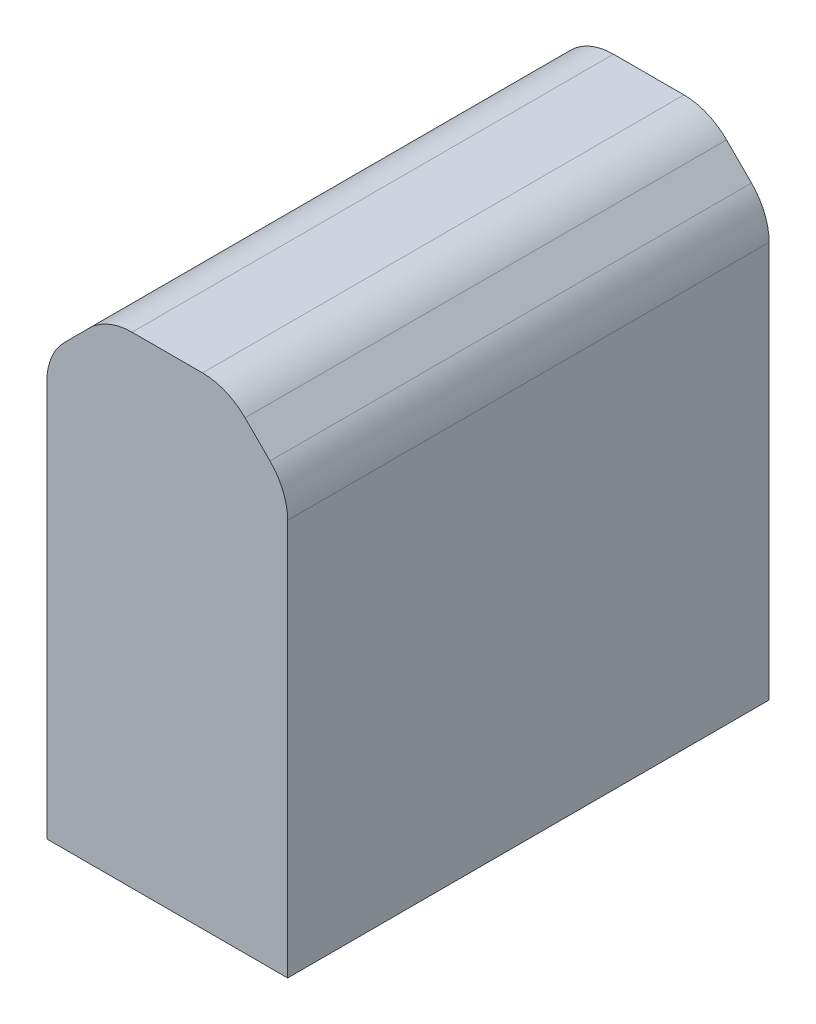
ISO-10303-21;
HEADER;
FILE_DESCRIPTION(('STEP AP214'),'2;1');
FILE_NAME('part.step','',(''),(''),'','','');
FILE_SCHEMA(('AUTOMOTIVE_DESIGN { 1 0 10303 214 1 1 1 1 }'));
ENDSEC;
DATA;
#1=APPLICATION_CONTEXT('core data for automotive mechanical design processes');
#2=APPLICATION_PROTOCOL_DEFINITION('international standard','automotive_design',2000,#1);
#3=PRODUCT_CONTEXT('',#1,'mechanical');
#4=PRODUCT('Part','Part','',(#3));
#5=PRODUCT_RELATED_PRODUCT_CATEGORY('part','',(#4));
#6=PRODUCT_DEFINITION_FORMATION('','',#4);
#7=PRODUCT_DEFINITION_CONTEXT('part definition',#1,'design');
#8=PRODUCT_DEFINITION('design','',#6,#7);
#9=PRODUCT_DEFINITION_SHAPE('','',#8);
#10=(LENGTH_UNIT() NAMED_UNIT(*) SI_UNIT(.MILLI.,.METRE.));
#11=(NAMED_UNIT(*) PLANE_ANGLE_UNIT() SI_UNIT($,.RADIAN.));
#12=(NAMED_UNIT(*) SI_UNIT($,.STERADIAN.) SOLID_ANGLE_UNIT());
#13=UNCERTAINTY_MEASURE_WITH_UNIT(LENGTH_MEASURE(1.E-05),#10,'distance_accuracy_value','');
#14=(GEOMETRIC_REPRESENTATION_CONTEXT(3) GLOBAL_UNCERTAINTY_ASSIGNED_CONTEXT((#13)) GLOBAL_UNIT_ASSIGNED_CONTEXT((#10,
#11,#12)) REPRESENTATION_CONTEXT('',''));
#15=CARTESIAN_POINT('',(0.,0.,0.));
#16=DIRECTION('',(0.,0.,1.));
#17=DIRECTION('',(1.,0.,0.));
#18=AXIS2_PLACEMENT_3D('',#15,#16,#17);
#19=CARTESIAN_POINT('',(1.,4.,-2.));
#20=DIRECTION('',(-1.,0.,0.));
#21=DIRECTION('',(0.,0.,1.));
#22=AXIS2_PLACEMENT_3D('',#19,#20,#21);
#23=PLANE('',#22);
#24=DIRECTION('',(0.,-1.,0.));
#25=VECTOR('',#24,1.);
#26=CARTESIAN_POINT('',(1.,4.,-2.));
#27=LINE('',#26,#25);
#28=CARTESIAN_POINT('',(1.,3.29289321881345,-2.));
#29=VERTEX_POINT('',#28);
#30=CARTESIAN_POINT('',(1.,0.,-2.));
#31=VERTEX_POINT('',#30);
#32=EDGE_CURVE('E108',#29,#31,#27,.T.);
#33=ORIENTED_EDGE('',*,*,#32,.F.);
#34=DIRECTION('',(0.,0.,1.));
#35=VECTOR('',#34,1.);
#36=CARTESIAN_POINT('',(1.,3.29289321881345,2.));
#37=LINE('',#36,#35);
#38=CARTESIAN_POINT('',(1.,3.29289321881345,2.));
#39=VERTEX_POINT('',#38);
#40=EDGE_CURVE('E183',#29,#39,#37,.T.);
#41=ORIENTED_EDGE('',*,*,#40,.T.);
#42=DIRECTION('',(0.,-1.,0.));
#43=VECTOR('',#42,1.);
#44=CARTESIAN_POINT('',(1.,4.,2.));
#45=LINE('',#44,#43);
#46=CARTESIAN_POINT('',(1.,0.,2.));
#47=VERTEX_POINT('',#46);
#48=EDGE_CURVE('E132',#39,#47,#45,.T.);
#49=ORIENTED_EDGE('',*,*,#48,.T.);
#50=DIRECTION('',(0.,0.,-1.));
#51=VECTOR('',#50,1.);
#52=CARTESIAN_POINT('',(1.,0.,-2.));
#53=LINE('',#52,#51);
#54=EDGE_CURVE('E128',#47,#31,#53,.T.);
#55=ORIENTED_EDGE('',*,*,#54,.T.);
#56=EDGE_LOOP('',(#33,#41,#49,#55));
#57=FACE_BOUND('',#56,.T.);
#58=ADVANCED_FACE('F32',(#57),#23,.F.);
#59=CARTESIAN_POINT('',(-1.,4.,-2.));
#60=DIRECTION('',(0.,0.,1.));
#61=DIRECTION('',(1.,0.,0.));
#62=AXIS2_PLACEMENT_3D('',#59,#60,#61);
#63=PLANE('',#62);
#64=DIRECTION('',(0.,-1.,0.));
#65=VECTOR('',#64,1.);
#66=CARTESIAN_POINT('',(-1.,4.,-2.));
#67=LINE('',#66,#65);
#68=CARTESIAN_POINT('',(-1.,3.29289321881345,-2.));
#69=VERTEX_POINT('',#68);
#70=CARTESIAN_POINT('',(-1.,0.,-2.));
#71=VERTEX_POINT('',#70);
#72=EDGE_CURVE('E122',#69,#71,#67,.T.);
#73=ORIENTED_EDGE('',*,*,#72,.F.);
#74=CARTESIAN_POINT('',(-0.5,3.29289321881345,-2.));
#75=DIRECTION('',(0.,0.,1.));
#76=DIRECTION('',(1.,0.,0.));
#77=AXIS2_PLACEMENT_3D('',#74,#75,#76);
#78=CIRCLE('',#77,0.5);
#79=CARTESIAN_POINT('',(-0.853553390593275,3.64644660940672,-2.));
#80=VERTEX_POINT('',#79);
#81=EDGE_CURVE('E164',#69,#80,#78,.F.);
#82=ORIENTED_EDGE('',*,*,#81,.T.);
#83=DIRECTION('',(0.707106781186546,0.707106781186549,0.));
#84=VECTOR('',#83,1.);
#85=CARTESIAN_POINT('',(-0.5,4.,-2.));
#86=LINE('',#85,#84);
#87=CARTESIAN_POINT('',(-0.646446609406727,3.85355339059327,-2.));
#88=VERTEX_POINT('',#87);
#89=EDGE_CURVE('E153',#80,#88,#86,.T.);
#90=ORIENTED_EDGE('',*,*,#89,.T.);
#91=CARTESIAN_POINT('',(-0.292893218813452,3.5,-2.));
#92=DIRECTION('',(0.,0.,1.));
#93=DIRECTION('',(1.,0.,0.));
#94=AXIS2_PLACEMENT_3D('',#91,#92,#93);
#95=CIRCLE('',#94,0.5);
#96=CARTESIAN_POINT('',(-0.292893218813452,4.,-2.));
#97=VERTEX_POINT('',#96);
#98=EDGE_CURVE('E162',#88,#97,#95,.F.);
#99=ORIENTED_EDGE('',*,*,#98,.T.);
#100=DIRECTION('',(-1.,0.,0.));
#101=VECTOR('',#100,1.);
#102=CARTESIAN_POINT('',(-1.,4.,-2.));
#103=LINE('',#102,#101);
#104=CARTESIAN_POINT('',(0.292893218813453,4.,-2.));
#105=VERTEX_POINT('',#104);
#106=EDGE_CURVE('E142',#105,#97,#103,.T.);
#107=ORIENTED_EDGE('',*,*,#106,.F.);
#108=CARTESIAN_POINT('',(0.292893218813453,3.5,-2.));
#109=DIRECTION('',(0.,0.,1.));
#110=DIRECTION('',(1.,0.,0.));
#111=AXIS2_PLACEMENT_3D('',#108,#109,#110);
#112=CIRCLE('',#111,0.5);
#113=CARTESIAN_POINT('',(0.646446609406728,3.85355339059327,-2.));
#114=VERTEX_POINT('',#113);
#115=EDGE_CURVE('E159',#105,#114,#112,.F.);
#116=ORIENTED_EDGE('',*,*,#115,.T.);
#117=DIRECTION('',(0.707106781186546,-0.707106781186549,0.));
#118=VECTOR('',#117,1.);
#119=CARTESIAN_POINT('',(0.500000000000001,4.,-2.));
#120=LINE('',#119,#118);
#121=CARTESIAN_POINT('',(0.853553390593275,3.64644660940673,-2.));
#122=VERTEX_POINT('',#121);
#123=EDGE_CURVE('E151',#114,#122,#120,.T.);
#124=ORIENTED_EDGE('',*,*,#123,.T.);
#125=CARTESIAN_POINT('',(0.5,3.29289321881345,-2.));
#126=DIRECTION('',(0.,0.,1.));
#127=DIRECTION('',(1.,0.,0.));
#128=AXIS2_PLACEMENT_3D('',#125,#126,#127);
#129=CIRCLE('',#128,0.5);
#130=EDGE_CURVE('E116',#122,#29,#129,.F.);
#131=ORIENTED_EDGE('',*,*,#130,.T.);
#132=ORIENTED_EDGE('',*,*,#32,.T.);
#133=DIRECTION('',(-1.,0.,0.));
#134=VECTOR('',#133,1.);
#135=CARTESIAN_POINT('',(-1.,0.,-2.));
#136=LINE('',#135,#134);
#137=EDGE_CURVE('E112',#31,#71,#136,.T.);
#138=ORIENTED_EDGE('',*,*,#137,.T.);
#139=EDGE_LOOP('',(#73,#82,#90,#99,#107,#116,#124,#131,#132,#138));
#140=FACE_BOUND('',#139,.T.);
#141=ADVANCED_FACE('F111',(#140),#63,.F.);
#142=CARTESIAN_POINT('',(-1.,4.,-2.));
#143=DIRECTION('',(1.,0.,0.));
#144=DIRECTION('',(0.,0.,-1.));
#145=AXIS2_PLACEMENT_3D('',#142,#143,#144);
#146=PLANE('',#145);
#147=DIRECTION('',(0.,-1.,0.));
#148=VECTOR('',#147,1.);
#149=CARTESIAN_POINT('',(-1.,4.,2.));
#150=LINE('',#149,#148);
#151=CARTESIAN_POINT('',(-1.,3.29289321881345,2.));
#152=VERTEX_POINT('',#151);
#153=CARTESIAN_POINT('',(-1.,0.,2.));
#154=VERTEX_POINT('',#153);
#155=EDGE_CURVE('E144',#152,#154,#150,.T.);
#156=ORIENTED_EDGE('',*,*,#155,.F.);
#157=DIRECTION('',(0.,0.,-1.));
#158=VECTOR('',#157,1.);
#159=CARTESIAN_POINT('',(-1.,3.29289321881345,-2.));
#160=LINE('',#159,#158);
#161=EDGE_CURVE('E156',#152,#69,#160,.T.);
#162=ORIENTED_EDGE('',*,*,#161,.T.);
#163=ORIENTED_EDGE('',*,*,#72,.T.);
#164=DIRECTION('',(0.,0.,1.));
#165=VECTOR('',#164,1.);
#166=CARTESIAN_POINT('',(-1.,0.,-2.));
#167=LINE('',#166,#165);
#168=EDGE_CURVE('E130',#71,#154,#167,.T.);
#169=ORIENTED_EDGE('',*,*,#168,.T.);
#170=EDGE_LOOP('',(#156,#162,#163,#169));
#171=FACE_BOUND('',#170,.T.);
#172=ADVANCED_FACE('F190',(#171),#146,.F.);
#173=CARTESIAN_POINT('',(-1.,4.,2.));
#174=DIRECTION('',(0.,0.,-1.));
#175=DIRECTION('',(-1.,0.,0.));
#176=AXIS2_PLACEMENT_3D('',#173,#174,#175);
#177=PLANE('',#176);
#178=DIRECTION('',(-0.707106781186546,-0.707106781186549,0.));
#179=VECTOR('',#178,1.);
#180=CARTESIAN_POINT('',(-0.5,4.,2.));
#181=LINE('',#180,#179);
#182=CARTESIAN_POINT('',(-0.646446609406726,3.85355339059327,2.));
#183=VERTEX_POINT('',#182);
#184=CARTESIAN_POINT('',(-0.853553390593274,3.64644660940672,2.));
#185=VERTEX_POINT('',#184);
#186=EDGE_CURVE('E148',#183,#185,#181,.T.);
#187=ORIENTED_EDGE('',*,*,#186,.T.);
#188=CARTESIAN_POINT('',(-0.5,3.29289321881345,2.));
#189=DIRECTION('',(0.,0.,-1.));
#190=DIRECTION('',(-1.,0.,0.));
#191=AXIS2_PLACEMENT_3D('',#188,#189,#190);
#192=CIRCLE('',#191,0.5);
#193=EDGE_CURVE('E175',#185,#152,#192,.F.);
#194=ORIENTED_EDGE('',*,*,#193,.T.);
#195=ORIENTED_EDGE('',*,*,#155,.T.);
#196=DIRECTION('',(1.,0.,0.));
#197=VECTOR('',#196,1.);
#198=CARTESIAN_POINT('',(-1.,0.,2.));
#199=LINE('',#198,#197);
#200=EDGE_CURVE('E140',#154,#47,#199,.T.);
#201=ORIENTED_EDGE('',*,*,#200,.T.);
#202=ORIENTED_EDGE('',*,*,#48,.F.);
#203=CARTESIAN_POINT('',(0.500000000000001,3.29289321881345,2.));
#204=DIRECTION('',(0.,0.,-1.));
#205=DIRECTION('',(-1.,0.,0.));
#206=AXIS2_PLACEMENT_3D('',#203,#204,#205);
#207=CIRCLE('',#206,0.5);
#208=CARTESIAN_POINT('',(0.853553390593275,3.64644660940673,2.));
#209=VERTEX_POINT('',#208);
#210=EDGE_CURVE('E53',#39,#209,#207,.F.);
#211=ORIENTED_EDGE('',*,*,#210,.T.);
#212=DIRECTION('',(-0.707106781186546,0.707106781186549,0.));
#213=VECTOR('',#212,1.);
#214=CARTESIAN_POINT('',(0.500000000000002,4.,2.));
#215=LINE('',#214,#213);
#216=CARTESIAN_POINT('',(0.646446609406728,3.85355339059327,2.));
#217=VERTEX_POINT('',#216);
#218=EDGE_CURVE('E121',#209,#217,#215,.T.);
#219=ORIENTED_EDGE('',*,*,#218,.T.);
#220=CARTESIAN_POINT('',(0.292893218813454,3.5,2.));
#221=DIRECTION('',(0.,0.,-1.));
#222=DIRECTION('',(-1.,0.,0.));
#223=AXIS2_PLACEMENT_3D('',#220,#221,#222);
#224=CIRCLE('',#223,0.5);
#225=CARTESIAN_POINT('',(0.292893218813454,4.,2.));
#226=VERTEX_POINT('',#225);
#227=EDGE_CURVE('E170',#217,#226,#224,.F.);
#228=ORIENTED_EDGE('',*,*,#227,.T.);
#229=DIRECTION('',(1.,0.,0.));
#230=VECTOR('',#229,1.);
#231=CARTESIAN_POINT('',(-1.,4.,2.));
#232=LINE('',#231,#230);
#233=CARTESIAN_POINT('',(-0.292893218813452,4.,2.));
#234=VERTEX_POINT('',#233);
#235=EDGE_CURVE('E136',#234,#226,#232,.T.);
#236=ORIENTED_EDGE('',*,*,#235,.F.);
#237=CARTESIAN_POINT('',(-0.292893218813452,3.5,2.));
#238=DIRECTION('',(0.,0.,-1.));
#239=DIRECTION('',(-1.,0.,0.));
#240=AXIS2_PLACEMENT_3D('',#237,#238,#239);
#241=CIRCLE('',#240,0.5);
#242=EDGE_CURVE('E173',#234,#183,#241,.F.);
#243=ORIENTED_EDGE('',*,*,#242,.T.);
#244=EDGE_LOOP('',(#187,#194,#195,#201,#202,#211,#219,#228,#236,#243));
#245=FACE_BOUND('',#244,.T.);
#246=ADVANCED_FACE('F185',(#245),#177,.F.);
#247=CARTESIAN_POINT('',(0.,4.,0.));
#248=DIRECTION('',(0.,1.,0.));
#249=DIRECTION('',(0.,0.,1.));
#250=AXIS2_PLACEMENT_3D('',#247,#248,#249);
#251=PLANE('',#250);
#252=ORIENTED_EDGE('',*,*,#106,.T.);
#253=DIRECTION('',(0.,0.,1.));
#254=VECTOR('',#253,1.);
#255=CARTESIAN_POINT('',(-0.292893218813452,4.,0.));
#256=LINE('',#255,#254);
#257=EDGE_CURVE('E180',#97,#234,#256,.T.);
#258=ORIENTED_EDGE('',*,*,#257,.T.);
#259=ORIENTED_EDGE('',*,*,#235,.T.);
#260=DIRECTION('',(0.,0.,-1.));
#261=VECTOR('',#260,1.);
#262=CARTESIAN_POINT('',(0.292893218813454,4.,0.));
#263=LINE('',#262,#261);
#264=EDGE_CURVE('E177',#226,#105,#263,.T.);
#265=ORIENTED_EDGE('',*,*,#264,.T.);
#266=EDGE_LOOP('',(#252,#258,#259,#265));
#267=FACE_BOUND('',#266,.T.);
#268=ADVANCED_FACE('F224',(#267),#251,.T.);
#269=CARTESIAN_POINT('',(0.,0.,0.));
#270=DIRECTION('',(0.,1.,0.));
#271=DIRECTION('',(0.,0.,1.));
#272=AXIS2_PLACEMENT_3D('',#269,#270,#271);
#273=PLANE('',#272);
#274=ORIENTED_EDGE('',*,*,#54,.F.);
#275=ORIENTED_EDGE('',*,*,#200,.F.);
#276=ORIENTED_EDGE('',*,*,#168,.F.);
#277=ORIENTED_EDGE('',*,*,#137,.F.);
#278=EDGE_LOOP('',(#274,#275,#276,#277));
#279=FACE_BOUND('',#278,.T.);
#280=ADVANCED_FACE('F126',(#279),#273,.F.);
#281=CARTESIAN_POINT('',(-0.5,4.,0.));
#282=DIRECTION('',(-0.707106781186549,0.707106781186546,0.));
#283=DIRECTION('',(0.,0.,-1.));
#284=AXIS2_PLACEMENT_3D('',#281,#282,#283);
#285=PLANE('',#284);
#286=ORIENTED_EDGE('',*,*,#89,.F.);
#287=DIRECTION('',(0.,0.,-1.));
#288=VECTOR('',#287,1.);
#289=CARTESIAN_POINT('',(-0.853553390593274,3.64644660940672,2.));
#290=LINE('',#289,#288);
#291=EDGE_CURVE('E168',#80,#185,#290,.F.);
#292=ORIENTED_EDGE('',*,*,#291,.T.);
#293=ORIENTED_EDGE('',*,*,#186,.F.);
#294=DIRECTION('',(0.,0.,1.));
#295=VECTOR('',#294,1.);
#296=CARTESIAN_POINT('',(-0.646446609406727,3.85355339059327,0.));
#297=LINE('',#296,#295);
#298=EDGE_CURVE('E166',#183,#88,#297,.F.);
#299=ORIENTED_EDGE('',*,*,#298,.T.);
#300=EDGE_LOOP('',(#286,#292,#293,#299));
#301=FACE_BOUND('',#300,.T.);
#302=ADVANCED_FACE('F196',(#301),#285,.T.);
#303=CARTESIAN_POINT('',(0.500000000000002,4.,0.));
#304=DIRECTION('',(0.707106781186549,0.707106781186546,0.));
#305=DIRECTION('',(0.,0.,1.));
#306=AXIS2_PLACEMENT_3D('',#303,#304,#305);
#307=PLANE('',#306);
#308=ORIENTED_EDGE('',*,*,#218,.F.);
#309=DIRECTION('',(0.,0.,1.));
#310=VECTOR('',#309,1.);
#311=CARTESIAN_POINT('',(0.853553390593275,3.64644660940673,-2.));
#312=LINE('',#311,#310);
#313=EDGE_CURVE('E11',#209,#122,#312,.F.);
#314=ORIENTED_EDGE('',*,*,#313,.T.);
#315=ORIENTED_EDGE('',*,*,#123,.F.);
#316=DIRECTION('',(0.,0.,-1.));
#317=VECTOR('',#316,1.);
#318=CARTESIAN_POINT('',(0.646446609406728,3.85355339059327,0.));
#319=LINE('',#318,#317);
#320=EDGE_CURVE('E40',#114,#217,#319,.F.);
#321=ORIENTED_EDGE('',*,*,#320,.T.);
#322=EDGE_LOOP('',(#308,#314,#315,#321));
#323=FACE_BOUND('',#322,.T.);
#324=ADVANCED_FACE('F202',(#323),#307,.T.);
#325=CARTESIAN_POINT('',(-0.5,3.29289321881345,-2.));
#326=DIRECTION('',(0.,0.,1.));
#327=DIRECTION('',(1.,0.,0.));
#328=AXIS2_PLACEMENT_3D('',#325,#326,#327);
#329=CYLINDRICAL_SURFACE('',#328,0.5);
#330=ORIENTED_EDGE('',*,*,#193,.F.);
#331=ORIENTED_EDGE('',*,*,#291,.F.);
#332=ORIENTED_EDGE('',*,*,#81,.F.);
#333=ORIENTED_EDGE('',*,*,#161,.F.);
#334=EDGE_LOOP('',(#330,#331,#332,#333));
#335=FACE_BOUND('',#334,.T.);
#336=ADVANCED_FACE('F199',(#335),#329,.T.);
#337=CARTESIAN_POINT('',(-0.292893218813452,3.5,0.));
#338=DIRECTION('',(0.,0.,1.));
#339=DIRECTION('',(1.,0.,0.));
#340=AXIS2_PLACEMENT_3D('',#337,#338,#339);
#341=CYLINDRICAL_SURFACE('',#340,0.5);
#342=ORIENTED_EDGE('',*,*,#98,.F.);
#343=ORIENTED_EDGE('',*,*,#298,.F.);
#344=ORIENTED_EDGE('',*,*,#242,.F.);
#345=ORIENTED_EDGE('',*,*,#257,.F.);
#346=EDGE_LOOP('',(#342,#343,#344,#345));
#347=FACE_BOUND('',#346,.T.);
#348=ADVANCED_FACE('F201',(#347),#341,.T.);
#349=CARTESIAN_POINT('',(0.5,3.29289321881345,-2.));
#350=DIRECTION('',(0.,0.,-1.));
#351=DIRECTION('',(-1.,0.,0.));
#352=AXIS2_PLACEMENT_3D('',#349,#350,#351);
#353=CYLINDRICAL_SURFACE('',#352,0.5);
#354=ORIENTED_EDGE('',*,*,#130,.F.);
#355=ORIENTED_EDGE('',*,*,#313,.F.);
#356=ORIENTED_EDGE('',*,*,#210,.F.);
#357=ORIENTED_EDGE('',*,*,#40,.F.);
#358=EDGE_LOOP('',(#354,#355,#356,#357));
#359=FACE_BOUND('',#358,.T.);
#360=ADVANCED_FACE('F208',(#359),#353,.T.);
#361=CARTESIAN_POINT('',(0.292893218813454,3.5,0.));
#362=DIRECTION('',(0.,0.,-1.));
#363=DIRECTION('',(-1.,0.,0.));
#364=AXIS2_PLACEMENT_3D('',#361,#362,#363);
#365=CYLINDRICAL_SURFACE('',#364,0.5);
#366=ORIENTED_EDGE('',*,*,#227,.F.);
#367=ORIENTED_EDGE('',*,*,#320,.F.);
#368=ORIENTED_EDGE('',*,*,#115,.F.);
#369=ORIENTED_EDGE('',*,*,#264,.F.);
#370=EDGE_LOOP('',(#366,#367,#368,#369));
#371=FACE_BOUND('',#370,.T.);
#372=ADVANCED_FACE('F34',(#371),#365,.T.);
#373=CLOSED_SHELL('',(#58,#141,#172,#246,#268,#280,#302,#324,#336,#348,#360,#372));
#374=MANIFOLD_SOLID_BREP('B2',#373);
#375=ADVANCED_BREP_SHAPE_REPRESENTATION('',(#18,#374),#14);
#376=SHAPE_DEFINITION_REPRESENTATION(#9,#375);
ENDSEC;
END-ISO-10303-21;
